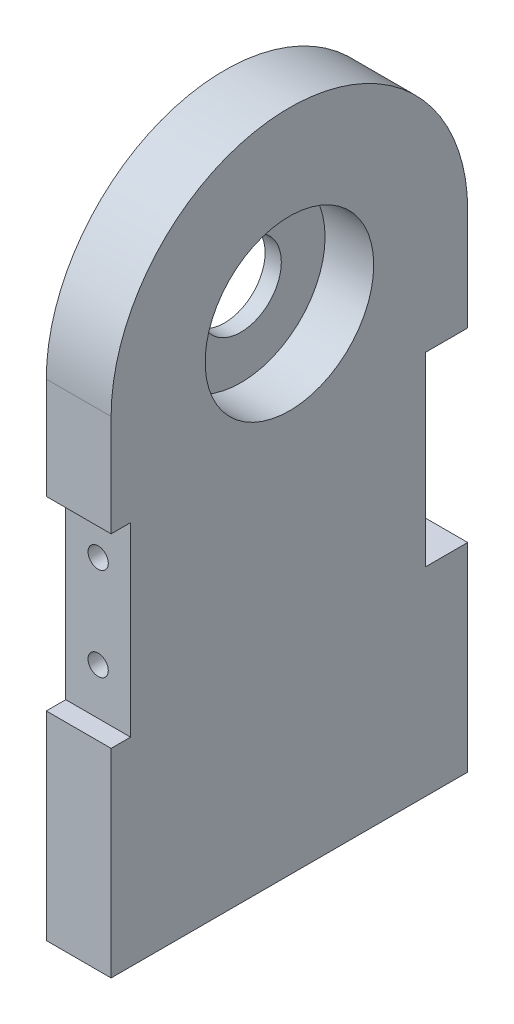
ISO-10303-21;
HEADER;
FILE_DESCRIPTION(('STEP AP214'),'2;1');
FILE_NAME('part.step','',(''),(''),'','','');
FILE_SCHEMA(('AUTOMOTIVE_DESIGN { 1 0 10303 214 1 1 1 1 }'));
ENDSEC;
DATA;
#1=APPLICATION_CONTEXT('core data for automotive mechanical design processes');
#2=APPLICATION_PROTOCOL_DEFINITION('international standard','automotive_design',2000,#1);
#3=PRODUCT_CONTEXT('',#1,'mechanical');
#4=PRODUCT('Part','Part','',(#3));
#5=PRODUCT_RELATED_PRODUCT_CATEGORY('part','',(#4));
#6=PRODUCT_DEFINITION_FORMATION('','',#4);
#7=PRODUCT_DEFINITION_CONTEXT('part definition',#1,'design');
#8=PRODUCT_DEFINITION('design','',#6,#7);
#9=PRODUCT_DEFINITION_SHAPE('','',#8);
#10=(LENGTH_UNIT() NAMED_UNIT(*) SI_UNIT(.MILLI.,.METRE.));
#11=(NAMED_UNIT(*) PLANE_ANGLE_UNIT() SI_UNIT($,.RADIAN.));
#12=(NAMED_UNIT(*) SI_UNIT($,.STERADIAN.) SOLID_ANGLE_UNIT());
#13=UNCERTAINTY_MEASURE_WITH_UNIT(LENGTH_MEASURE(1.E-05),#10,'distance_accuracy_value','');
#14=(GEOMETRIC_REPRESENTATION_CONTEXT(3) GLOBAL_UNCERTAINTY_ASSIGNED_CONTEXT((#13)) GLOBAL_UNIT_ASSIGNED_CONTEXT((#10,
#11,#12)) REPRESENTATION_CONTEXT('',''));
#15=CARTESIAN_POINT('',(0.,0.,0.));
#16=DIRECTION('',(0.,0.,1.));
#17=DIRECTION('',(1.,0.,0.));
#18=AXIS2_PLACEMENT_3D('',#15,#16,#17);
#19=CARTESIAN_POINT('',(20.,0.,-55.));
#20=DIRECTION('',(0.,0.,-1.));
#21=DIRECTION('',(0.,1.,0.));
#22=AXIS2_PLACEMENT_3D('',#19,#20,#21);
#23=PLANE('',#22);
#24=DIRECTION('',(1.,0.,0.));
#25=VECTOR('',#24,1.);
#26=CARTESIAN_POINT('',(0.,-13.65,-55.));
#27=LINE('',#26,#25);
#28=CARTESIAN_POINT('',(0.,-13.65,-55.));
#29=VERTEX_POINT('',#28);
#30=CARTESIAN_POINT('',(20.,-13.65,-55.));
#31=VERTEX_POINT('',#30);
#32=EDGE_CURVE('E247',#29,#31,#27,.T.);
#33=ORIENTED_EDGE('',*,*,#32,.T.);
#34=DIRECTION('',(0.,-1.,0.));
#35=VECTOR('',#34,1.);
#36=CARTESIAN_POINT('',(20.,0.,-55.));
#37=LINE('',#36,#35);
#38=CARTESIAN_POINT('',(20.,-75.,-55.));
#39=VERTEX_POINT('',#38);
#40=EDGE_CURVE('E325',#31,#39,#37,.T.);
#41=ORIENTED_EDGE('',*,*,#40,.T.);
#42=DIRECTION('',(-1.,0.,0.));
#43=VECTOR('',#42,1.);
#44=CARTESIAN_POINT('',(20.,-75.,-55.));
#45=LINE('',#44,#43);
#46=CARTESIAN_POINT('',(0.,-75.,-55.));
#47=VERTEX_POINT('',#46);
#48=EDGE_CURVE('E337',#39,#47,#45,.T.);
#49=ORIENTED_EDGE('',*,*,#48,.T.);
#50=DIRECTION('',(0.,-1.,0.));
#51=VECTOR('',#50,1.);
#52=CARTESIAN_POINT('',(0.,0.,-55.));
#53=LINE('',#52,#51);
#54=EDGE_CURVE('E315',#29,#47,#53,.T.);
#55=ORIENTED_EDGE('',*,*,#54,.F.);
#56=EDGE_LOOP('',(#33,#41,#49,#55));
#57=FACE_BOUND('',#56,.T.);
#58=ADVANCED_FACE('F43',(#57),#23,.T.);
#59=CARTESIAN_POINT('',(20.,0.,55.));
#60=DIRECTION('',(0.,0.,-1.));
#61=DIRECTION('',(0.,1.,0.));
#62=AXIS2_PLACEMENT_3D('',#59,#60,#61);
#63=PLANE('',#62);
#64=DIRECTION('',(0.,-1.,0.));
#65=VECTOR('',#64,1.);
#66=CARTESIAN_POINT('',(20.,0.,55.));
#67=LINE('',#66,#65);
#68=CARTESIAN_POINT('',(20.,-13.65,55.));
#69=VERTEX_POINT('',#68);
#70=CARTESIAN_POINT('',(20.,-75.,55.));
#71=VERTEX_POINT('',#70);
#72=EDGE_CURVE('E328',#69,#71,#67,.T.);
#73=ORIENTED_EDGE('',*,*,#72,.F.);
#74=DIRECTION('',(1.,0.,0.));
#75=VECTOR('',#74,1.);
#76=CARTESIAN_POINT('',(0.,-13.65,55.));
#77=LINE('',#76,#75);
#78=CARTESIAN_POINT('',(0.,-13.65,55.));
#79=VERTEX_POINT('',#78);
#80=EDGE_CURVE('E223',#79,#69,#77,.T.);
#81=ORIENTED_EDGE('',*,*,#80,.F.);
#82=DIRECTION('',(0.,-1.,0.));
#83=VECTOR('',#82,1.);
#84=CARTESIAN_POINT('',(0.,0.,55.));
#85=LINE('',#84,#83);
#86=CARTESIAN_POINT('',(0.,-75.,55.));
#87=VERTEX_POINT('',#86);
#88=EDGE_CURVE('E345',#79,#87,#85,.T.);
#89=ORIENTED_EDGE('',*,*,#88,.T.);
#90=DIRECTION('',(-1.,0.,0.));
#91=VECTOR('',#90,1.);
#92=CARTESIAN_POINT('',(20.,-75.,55.));
#93=LINE('',#92,#91);
#94=EDGE_CURVE('E357',#71,#87,#93,.T.);
#95=ORIENTED_EDGE('',*,*,#94,.F.);
#96=EDGE_LOOP('',(#73,#81,#89,#95));
#97=FACE_BOUND('',#96,.T.);
#98=ADVANCED_FACE('F427',(#97),#63,.F.);
#99=DIRECTION('',(1.,0.,0.));
#100=VECTOR('',#99,1.);
#101=CARTESIAN_POINT('',(0.,43.65,-55.));
#102=LINE('',#101,#100);
#103=CARTESIAN_POINT('',(0.,43.65,-55.));
#104=VERTEX_POINT('',#103);
#105=CARTESIAN_POINT('',(20.,43.65,-55.));
#106=VERTEX_POINT('',#105);
#107=EDGE_CURVE('E262',#104,#106,#102,.T.);
#108=ORIENTED_EDGE('',*,*,#107,.F.);
#109=CARTESIAN_POINT('',(0.,75.,-55.));
#110=VERTEX_POINT('',#109);
#111=EDGE_CURVE('E338',#110,#104,#53,.T.);
#112=ORIENTED_EDGE('',*,*,#111,.F.);
#113=DIRECTION('',(-1.,0.,0.));
#114=VECTOR('',#113,1.);
#115=CARTESIAN_POINT('',(20.,75.,-55.));
#116=LINE('',#115,#114);
#117=CARTESIAN_POINT('',(20.,75.,-55.));
#118=VERTEX_POINT('',#117);
#119=EDGE_CURVE('E11',#118,#110,#116,.T.);
#120=ORIENTED_EDGE('',*,*,#119,.F.);
#121=EDGE_CURVE('E320',#118,#106,#37,.T.);
#122=ORIENTED_EDGE('',*,*,#121,.T.);
#123=EDGE_LOOP('',(#108,#112,#120,#122));
#124=FACE_BOUND('',#123,.T.);
#125=ADVANCED_FACE('F45',(#124),#23,.T.);
#126=CARTESIAN_POINT('',(20.,75.,0.));
#127=DIRECTION('',(-1.,0.,0.));
#128=DIRECTION('',(0.,0.,1.));
#129=AXIS2_PLACEMENT_3D('',#126,#127,#128);
#130=CYLINDRICAL_SURFACE('',#129,55.);
#131=CARTESIAN_POINT('',(0.,75.,0.));
#132=DIRECTION('',(1.,0.,0.));
#133=DIRECTION('',(0.,0.,-1.));
#134=AXIS2_PLACEMENT_3D('',#131,#132,#133);
#135=CIRCLE('',#134,55.);
#136=CARTESIAN_POINT('',(0.,75.,55.));
#137=VERTEX_POINT('',#136);
#138=EDGE_CURVE('E342',#110,#137,#135,.T.);
#139=ORIENTED_EDGE('',*,*,#138,.T.);
#140=DIRECTION('',(-1.,0.,0.));
#141=VECTOR('',#140,1.);
#142=CARTESIAN_POINT('',(20.,75.,55.));
#143=LINE('',#142,#141);
#144=CARTESIAN_POINT('',(20.,75.,55.));
#145=VERTEX_POINT('',#144);
#146=EDGE_CURVE('E53',#145,#137,#143,.T.);
#147=ORIENTED_EDGE('',*,*,#146,.F.);
#148=CARTESIAN_POINT('',(20.,75.,0.));
#149=DIRECTION('',(1.,0.,0.));
#150=DIRECTION('',(0.,0.,-1.));
#151=AXIS2_PLACEMENT_3D('',#148,#149,#150);
#152=CIRCLE('',#151,55.);
#153=EDGE_CURVE('E324',#118,#145,#152,.T.);
#154=ORIENTED_EDGE('',*,*,#153,.F.);
#155=ORIENTED_EDGE('',*,*,#119,.T.);
#156=EDGE_LOOP('',(#139,#147,#154,#155));
#157=FACE_BOUND('',#156,.T.);
#158=ADVANCED_FACE('F388',(#157),#130,.T.);
#159=CARTESIAN_POINT('',(0.,43.65,55.));
#160=VERTEX_POINT('',#159);
#161=EDGE_CURVE('E346',#137,#160,#85,.T.);
#162=ORIENTED_EDGE('',*,*,#161,.T.);
#163=DIRECTION('',(1.,0.,0.));
#164=VECTOR('',#163,1.);
#165=CARTESIAN_POINT('',(0.,43.65,55.));
#166=LINE('',#165,#164);
#167=CARTESIAN_POINT('',(20.,43.65,55.));
#168=VERTEX_POINT('',#167);
#169=EDGE_CURVE('E227',#160,#168,#166,.T.);
#170=ORIENTED_EDGE('',*,*,#169,.T.);
#171=EDGE_CURVE('E329',#145,#168,#67,.T.);
#172=ORIENTED_EDGE('',*,*,#171,.F.);
#173=ORIENTED_EDGE('',*,*,#146,.T.);
#174=EDGE_LOOP('',(#162,#170,#172,#173));
#175=FACE_BOUND('',#174,.T.);
#176=ADVANCED_FACE('F367',(#175),#63,.F.);
#177=CARTESIAN_POINT('',(20.,-75.,0.));
#178=DIRECTION('',(0.,-1.,0.));
#179=DIRECTION('',(0.,0.,-1.));
#180=AXIS2_PLACEMENT_3D('',#177,#178,#179);
#181=PLANE('',#180);
#182=CARTESIAN_POINT('',(10.,-75.,36.6666666666666));
#183=DIRECTION('',(0.,-1.,0.));
#184=DIRECTION('',(0.,0.,-1.));
#185=AXIS2_PLACEMENT_3D('',#182,#183,#184);
#186=CIRCLE('',#185,2.49999999999999);
#187=CARTESIAN_POINT('',(10.,-75.,34.1666666666667));
#188=VERTEX_POINT('',#187);
#189=EDGE_CURVE('E226',#188,#188,#186,.T.);
#190=ORIENTED_EDGE('',*,*,#189,.F.);
#191=EDGE_LOOP('',(#190));
#192=FACE_BOUND('',#191,.T.);
#193=CARTESIAN_POINT('',(10.,-75.,18.3333333333333));
#194=DIRECTION('',(0.,-1.,0.));
#195=DIRECTION('',(0.,0.,-1.));
#196=AXIS2_PLACEMENT_3D('',#193,#194,#195);
#197=CIRCLE('',#196,2.49999999999999);
#198=CARTESIAN_POINT('',(10.,-75.,15.8333333333333));
#199=VERTEX_POINT('',#198);
#200=EDGE_CURVE('E275',#199,#199,#197,.T.);
#201=ORIENTED_EDGE('',*,*,#200,.F.);
#202=EDGE_LOOP('',(#201));
#203=FACE_BOUND('',#202,.T.);
#204=CARTESIAN_POINT('',(10.,-75.,0.));
#205=DIRECTION('',(0.,-1.,0.));
#206=DIRECTION('',(0.,0.,-1.));
#207=AXIS2_PLACEMENT_3D('',#204,#205,#206);
#208=CIRCLE('',#207,2.49999999999999);
#209=CARTESIAN_POINT('',(10.,-75.,-2.50000000000001));
#210=VERTEX_POINT('',#209);
#211=EDGE_CURVE('E283',#210,#210,#208,.T.);
#212=ORIENTED_EDGE('',*,*,#211,.F.);
#213=EDGE_LOOP('',(#212));
#214=FACE_BOUND('',#213,.T.);
#215=CARTESIAN_POINT('',(10.,-75.,-18.3333333333334));
#216=DIRECTION('',(0.,-1.,0.));
#217=DIRECTION('',(0.,0.,-1.));
#218=AXIS2_PLACEMENT_3D('',#215,#216,#217);
#219=CIRCLE('',#218,2.49999999999999);
#220=CARTESIAN_POINT('',(10.,-75.,-20.8333333333333));
#221=VERTEX_POINT('',#220);
#222=EDGE_CURVE('E291',#221,#221,#219,.T.);
#223=ORIENTED_EDGE('',*,*,#222,.F.);
#224=EDGE_LOOP('',(#223));
#225=FACE_BOUND('',#224,.T.);
#226=CARTESIAN_POINT('',(10.,-75.,-36.6666666666667));
#227=DIRECTION('',(0.,-1.,0.));
#228=DIRECTION('',(0.,0.,-1.));
#229=AXIS2_PLACEMENT_3D('',#226,#227,#228);
#230=CIRCLE('',#229,2.49999999999999);
#231=CARTESIAN_POINT('',(10.,-75.,-39.1666666666667));
#232=VERTEX_POINT('',#231);
#233=EDGE_CURVE('E299',#232,#232,#230,.T.);
#234=ORIENTED_EDGE('',*,*,#233,.F.);
#235=EDGE_LOOP('',(#234));
#236=FACE_BOUND('',#235,.T.);
#237=DIRECTION('',(0.,0.,1.));
#238=VECTOR('',#237,1.);
#239=CARTESIAN_POINT('',(0.,-75.,0.));
#240=LINE('',#239,#238);
#241=EDGE_CURVE('E350',#47,#87,#240,.T.);
#242=ORIENTED_EDGE('',*,*,#241,.F.);
#243=ORIENTED_EDGE('',*,*,#48,.F.);
#244=DIRECTION('',(0.,0.,1.));
#245=VECTOR('',#244,1.);
#246=CARTESIAN_POINT('',(20.,-75.,0.));
#247=LINE('',#246,#245);
#248=EDGE_CURVE('E333',#39,#71,#247,.T.);
#249=ORIENTED_EDGE('',*,*,#248,.T.);
#250=ORIENTED_EDGE('',*,*,#94,.T.);
#251=EDGE_LOOP('',(#242,#243,#249,#250));
#252=FACE_BOUND('',#251,.T.);
#253=ADVANCED_FACE('F440',(#192,#203,#214,#225,#236,#252),#181,.T.);
#254=CARTESIAN_POINT('',(20.,0.,0.));
#255=DIRECTION('',(1.,0.,0.));
#256=DIRECTION('',(0.,0.,-1.));
#257=AXIS2_PLACEMENT_3D('',#254,#255,#256);
#258=PLANE('',#257);
#259=DIRECTION('',(0.,0.,-1.));
#260=VECTOR('',#259,1.);
#261=CARTESIAN_POINT('',(20.,-13.65,49.));
#262=LINE('',#261,#260);
#263=CARTESIAN_POINT('',(20.,-13.65,49.));
#264=VERTEX_POINT('',#263);
#265=EDGE_CURVE('E212',#69,#264,#262,.T.);
#266=ORIENTED_EDGE('',*,*,#265,.F.);
#267=ORIENTED_EDGE('',*,*,#72,.T.);
#268=ORIENTED_EDGE('',*,*,#248,.F.);
#269=ORIENTED_EDGE('',*,*,#40,.F.);
#270=DIRECTION('',(0.,0.,-1.));
#271=VECTOR('',#270,1.);
#272=CARTESIAN_POINT('',(20.,-13.65,-42.));
#273=LINE('',#272,#271);
#274=CARTESIAN_POINT('',(20.,-13.65,-42.));
#275=VERTEX_POINT('',#274);
#276=EDGE_CURVE('E199',#275,#31,#273,.T.);
#277=ORIENTED_EDGE('',*,*,#276,.F.);
#278=DIRECTION('',(0.,-1.,0.));
#279=VECTOR('',#278,1.);
#280=CARTESIAN_POINT('',(20.,43.65,-42.));
#281=LINE('',#280,#279);
#282=CARTESIAN_POINT('',(20.,43.65,-42.));
#283=VERTEX_POINT('',#282);
#284=EDGE_CURVE('E241',#283,#275,#281,.T.);
#285=ORIENTED_EDGE('',*,*,#284,.F.);
#286=DIRECTION('',(0.,0.,1.));
#287=VECTOR('',#286,1.);
#288=CARTESIAN_POINT('',(20.,43.65,-55.));
#289=LINE('',#288,#287);
#290=EDGE_CURVE('E250',#106,#283,#289,.T.);
#291=ORIENTED_EDGE('',*,*,#290,.F.);
#292=ORIENTED_EDGE('',*,*,#121,.F.);
#293=ORIENTED_EDGE('',*,*,#153,.T.);
#294=ORIENTED_EDGE('',*,*,#171,.T.);
#295=DIRECTION('',(0.,0.,1.));
#296=VECTOR('',#295,1.);
#297=CARTESIAN_POINT('',(20.,43.65,55.));
#298=LINE('',#297,#296);
#299=CARTESIAN_POINT('',(20.,43.65,49.));
#300=VERTEX_POINT('',#299);
#301=EDGE_CURVE('E205',#300,#168,#298,.T.);
#302=ORIENTED_EDGE('',*,*,#301,.F.);
#303=DIRECTION('',(0.,1.,0.));
#304=VECTOR('',#303,1.);
#305=CARTESIAN_POINT('',(20.,43.65,49.));
#306=LINE('',#305,#304);
#307=EDGE_CURVE('E216',#264,#300,#306,.T.);
#308=ORIENTED_EDGE('',*,*,#307,.F.);
#309=EDGE_LOOP('',(#266,#267,#268,#269,#277,#285,#291,#292,#293,#294,#302,#308));
#310=FACE_BOUND('',#309,.T.);
#311=CARTESIAN_POINT('',(20.,75.,0.));
#312=DIRECTION('',(1.,0.,0.));
#313=DIRECTION('',(0.,0.,-1.));
#314=AXIS2_PLACEMENT_3D('',#311,#312,#313);
#315=CIRCLE('',#314,26.);
#316=CARTESIAN_POINT('',(20.,75.,-26.));
#317=VERTEX_POINT('',#316);
#318=EDGE_CURVE('E316',#317,#317,#315,.T.);
#319=ORIENTED_EDGE('',*,*,#318,.F.);
#320=EDGE_LOOP('',(#319));
#321=FACE_BOUND('',#320,.T.);
#322=ADVANCED_FACE('F384',(#310,#321),#258,.T.);
#323=CARTESIAN_POINT('',(0.,0.,0.));
#324=DIRECTION('',(1.,0.,0.));
#325=DIRECTION('',(0.,0.,-1.));
#326=AXIS2_PLACEMENT_3D('',#323,#324,#325);
#327=PLANE('',#326);
#328=ORIENTED_EDGE('',*,*,#88,.F.);
#329=DIRECTION('',(0.,0.,-1.));
#330=VECTOR('',#329,1.);
#331=CARTESIAN_POINT('',(0.,-13.65,49.));
#332=LINE('',#331,#330);
#333=CARTESIAN_POINT('',(0.,-13.65,49.));
#334=VERTEX_POINT('',#333);
#335=EDGE_CURVE('E200',#79,#334,#332,.T.);
#336=ORIENTED_EDGE('',*,*,#335,.T.);
#337=DIRECTION('',(0.,1.,0.));
#338=VECTOR('',#337,1.);
#339=CARTESIAN_POINT('',(0.,43.65,49.));
#340=LINE('',#339,#338);
#341=CARTESIAN_POINT('',(0.,43.65,49.));
#342=VERTEX_POINT('',#341);
#343=EDGE_CURVE('E204',#334,#342,#340,.T.);
#344=ORIENTED_EDGE('',*,*,#343,.T.);
#345=DIRECTION('',(0.,0.,1.));
#346=VECTOR('',#345,1.);
#347=CARTESIAN_POINT('',(0.,43.65,55.));
#348=LINE('',#347,#346);
#349=EDGE_CURVE('E60',#342,#160,#348,.T.);
#350=ORIENTED_EDGE('',*,*,#349,.T.);
#351=ORIENTED_EDGE('',*,*,#161,.F.);
#352=ORIENTED_EDGE('',*,*,#138,.F.);
#353=ORIENTED_EDGE('',*,*,#111,.T.);
#354=DIRECTION('',(0.,0.,1.));
#355=VECTOR('',#354,1.);
#356=CARTESIAN_POINT('',(0.,43.65,-55.));
#357=LINE('',#356,#355);
#358=CARTESIAN_POINT('',(0.,43.65,-42.));
#359=VERTEX_POINT('',#358);
#360=EDGE_CURVE('E240',#104,#359,#357,.T.);
#361=ORIENTED_EDGE('',*,*,#360,.T.);
#362=DIRECTION('',(0.,-1.,0.));
#363=VECTOR('',#362,1.);
#364=CARTESIAN_POINT('',(0.,43.65,-42.));
#365=LINE('',#364,#363);
#366=CARTESIAN_POINT('',(0.,-13.65,-42.));
#367=VERTEX_POINT('',#366);
#368=EDGE_CURVE('E68',#359,#367,#365,.T.);
#369=ORIENTED_EDGE('',*,*,#368,.T.);
#370=DIRECTION('',(0.,0.,-1.));
#371=VECTOR('',#370,1.);
#372=CARTESIAN_POINT('',(0.,-13.65,-42.));
#373=LINE('',#372,#371);
#374=EDGE_CURVE('E236',#367,#29,#373,.T.);
#375=ORIENTED_EDGE('',*,*,#374,.T.);
#376=ORIENTED_EDGE('',*,*,#54,.T.);
#377=ORIENTED_EDGE('',*,*,#241,.T.);
#378=EDGE_LOOP('',(#328,#336,#344,#350,#351,#352,#353,#361,#369,#375,#376,#377));
#379=FACE_BOUND('',#378,.T.);
#380=CARTESIAN_POINT('',(0.,75.,0.));
#381=DIRECTION('',(1.,0.,0.));
#382=DIRECTION('',(0.,0.,-1.));
#383=AXIS2_PLACEMENT_3D('',#380,#381,#382);
#384=CIRCLE('',#383,12.5);
#385=CARTESIAN_POINT('',(0.,75.,-12.5));
#386=VERTEX_POINT('',#385);
#387=EDGE_CURVE('E47',#386,#386,#384,.T.);
#388=ORIENTED_EDGE('',*,*,#387,.T.);
#389=EDGE_LOOP('',(#388));
#390=FACE_BOUND('',#389,.T.);
#391=ADVANCED_FACE('F373',(#379,#390),#327,.F.);
#392=CARTESIAN_POINT('',(5.,75.,0.));
#393=DIRECTION('',(1.,0.,0.));
#394=DIRECTION('',(0.,0.,-1.));
#395=AXIS2_PLACEMENT_3D('',#392,#393,#394);
#396=CYLINDRICAL_SURFACE('',#395,26.);
#397=CARTESIAN_POINT('',(5.,75.,0.));
#398=DIRECTION('',(1.,0.,0.));
#399=DIRECTION('',(0.,0.,-1.));
#400=AXIS2_PLACEMENT_3D('',#397,#398,#399);
#401=CIRCLE('',#400,26.);
#402=CARTESIAN_POINT('',(5.,75.,-26.));
#403=VERTEX_POINT('',#402);
#404=EDGE_CURVE('E311',#403,#403,#401,.T.);
#405=ORIENTED_EDGE('',*,*,#404,.F.);
#406=EDGE_LOOP('',(#405));
#407=FACE_BOUND('',#406,.T.);
#408=ORIENTED_EDGE('',*,*,#318,.T.);
#409=EDGE_LOOP('',(#408));
#410=FACE_BOUND('',#409,.T.);
#411=ADVANCED_FACE('F423',(#407,#410),#396,.F.);
#412=CARTESIAN_POINT('',(5.,75.,0.));
#413=DIRECTION('',(1.,0.,0.));
#414=DIRECTION('',(0.,0.,-1.));
#415=AXIS2_PLACEMENT_3D('',#412,#413,#414);
#416=PLANE('',#415);
#417=CARTESIAN_POINT('',(5.,75.,0.));
#418=DIRECTION('',(1.,0.,0.));
#419=DIRECTION('',(0.,0.,-1.));
#420=AXIS2_PLACEMENT_3D('',#417,#418,#419);
#421=CIRCLE('',#420,12.5);
#422=CARTESIAN_POINT('',(5.,75.,-12.5));
#423=VERTEX_POINT('',#422);
#424=EDGE_CURVE('E307',#423,#423,#421,.T.);
#425=ORIENTED_EDGE('',*,*,#424,.F.);
#426=EDGE_LOOP('',(#425));
#427=FACE_BOUND('',#426,.T.);
#428=ORIENTED_EDGE('',*,*,#404,.T.);
#429=EDGE_LOOP('',(#428));
#430=FACE_BOUND('',#429,.T.);
#431=ADVANCED_FACE('F413',(#427,#430),#416,.T.);
#432=CARTESIAN_POINT('',(-6.1125,75.,0.));
#433=DIRECTION('',(1.,0.,0.));
#434=DIRECTION('',(0.,0.,-1.));
#435=AXIS2_PLACEMENT_3D('',#432,#433,#434);
#436=CYLINDRICAL_SURFACE('',#435,12.5);
#437=ORIENTED_EDGE('',*,*,#424,.T.);
#438=EDGE_LOOP('',(#437));
#439=FACE_BOUND('',#438,.T.);
#440=ORIENTED_EDGE('',*,*,#387,.F.);
#441=EDGE_LOOP('',(#440));
#442=FACE_BOUND('',#441,.T.);
#443=ADVANCED_FACE('F410',(#439,#442),#436,.F.);
#444=CARTESIAN_POINT('',(10.,-35.,-36.6666666666667));
#445=DIRECTION('',(0.,-1.,0.));
#446=DIRECTION('',(0.,0.,-1.));
#447=AXIS2_PLACEMENT_3D('',#444,#445,#446);
#448=CONICAL_SURFACE('',#447,2.5,1.02974425867665);
#449=CARTESIAN_POINT('',(9.99999999999999,-33.4978484524311,-36.6666666666667));
#450=VERTEX_POINT('',#449);
#451=VERTEX_LOOP('',#450);
#452=FACE_BOUND('',#451,.T.);
#453=CARTESIAN_POINT('',(10.,-35.,-36.6666666666667));
#454=DIRECTION('',(0.,-1.,0.));
#455=DIRECTION('',(0.,0.,-1.));
#456=AXIS2_PLACEMENT_3D('',#453,#454,#455);
#457=CIRCLE('',#456,2.5);
#458=CARTESIAN_POINT('',(10.,-35.,-39.1666666666667));
#459=VERTEX_POINT('',#458);
#460=EDGE_CURVE('E303',#459,#459,#457,.T.);
#461=ORIENTED_EDGE('',*,*,#460,.T.);
#462=EDGE_LOOP('',(#461));
#463=FACE_BOUND('',#462,.T.);
#464=ADVANCED_FACE('F412',(#452,#463),#448,.F.);
#465=CARTESIAN_POINT('',(10.,-75.,-36.6666666666667));
#466=DIRECTION('',(0.,-1.,0.));
#467=DIRECTION('',(0.,0.,-1.));
#468=AXIS2_PLACEMENT_3D('',#465,#466,#467);
#469=CYLINDRICAL_SURFACE('',#468,2.49999999999999);
#470=ORIENTED_EDGE('',*,*,#460,.F.);
#471=EDGE_LOOP('',(#470));
#472=FACE_BOUND('',#471,.T.);
#473=ORIENTED_EDGE('',*,*,#233,.T.);
#474=EDGE_LOOP('',(#473));
#475=FACE_BOUND('',#474,.T.);
#476=ADVANCED_FACE('F420',(#472,#475),#469,.F.);
#477=CARTESIAN_POINT('',(10.,-35.,-18.3333333333334));
#478=DIRECTION('',(0.,-1.,0.));
#479=DIRECTION('',(0.,0.,-1.));
#480=AXIS2_PLACEMENT_3D('',#477,#478,#479);
#481=CONICAL_SURFACE('',#480,2.5,1.02974425867665);
#482=CARTESIAN_POINT('',(9.99999999999999,-33.4978484524311,-18.3333333333334));
#483=VERTEX_POINT('',#482);
#484=VERTEX_LOOP('',#483);
#485=FACE_BOUND('',#484,.T.);
#486=CARTESIAN_POINT('',(10.,-35.,-18.3333333333334));
#487=DIRECTION('',(0.,-1.,0.));
#488=DIRECTION('',(0.,0.,-1.));
#489=AXIS2_PLACEMENT_3D('',#486,#487,#488);
#490=CIRCLE('',#489,2.5);
#491=CARTESIAN_POINT('',(10.,-35.,-20.8333333333333));
#492=VERTEX_POINT('',#491);
#493=EDGE_CURVE('E295',#492,#492,#490,.T.);
#494=ORIENTED_EDGE('',*,*,#493,.T.);
#495=EDGE_LOOP('',(#494));
#496=FACE_BOUND('',#495,.T.);
#497=ADVANCED_FACE('F490',(#485,#496),#481,.F.);
#498=CARTESIAN_POINT('',(10.,-75.,-18.3333333333334));
#499=DIRECTION('',(0.,-1.,0.));
#500=DIRECTION('',(0.,0.,-1.));
#501=AXIS2_PLACEMENT_3D('',#498,#499,#500);
#502=CYLINDRICAL_SURFACE('',#501,2.49999999999999);
#503=ORIENTED_EDGE('',*,*,#493,.F.);
#504=EDGE_LOOP('',(#503));
#505=FACE_BOUND('',#504,.T.);
#506=ORIENTED_EDGE('',*,*,#222,.T.);
#507=EDGE_LOOP('',(#506));
#508=FACE_BOUND('',#507,.T.);
#509=ADVANCED_FACE('F500',(#505,#508),#502,.F.);
#510=CARTESIAN_POINT('',(10.,-35.,0.));
#511=DIRECTION('',(0.,-1.,0.));
#512=DIRECTION('',(0.,0.,-1.));
#513=AXIS2_PLACEMENT_3D('',#510,#511,#512);
#514=CONICAL_SURFACE('',#513,2.5,1.02974425867665);
#515=CARTESIAN_POINT('',(9.99999999999999,-33.4978484524311,0.));
#516=VERTEX_POINT('',#515);
#517=VERTEX_LOOP('',#516);
#518=FACE_BOUND('',#517,.T.);
#519=CARTESIAN_POINT('',(10.,-35.,0.));
#520=DIRECTION('',(0.,-1.,0.));
#521=DIRECTION('',(0.,0.,-1.));
#522=AXIS2_PLACEMENT_3D('',#519,#520,#521);
#523=CIRCLE('',#522,2.5);
#524=CARTESIAN_POINT('',(10.,-35.,-2.50000000000002));
#525=VERTEX_POINT('',#524);
#526=EDGE_CURVE('E287',#525,#525,#523,.T.);
#527=ORIENTED_EDGE('',*,*,#526,.T.);
#528=EDGE_LOOP('',(#527));
#529=FACE_BOUND('',#528,.T.);
#530=ADVANCED_FACE('F510',(#518,#529),#514,.F.);
#531=CARTESIAN_POINT('',(10.,-75.,0.));
#532=DIRECTION('',(0.,-1.,0.));
#533=DIRECTION('',(0.,0.,-1.));
#534=AXIS2_PLACEMENT_3D('',#531,#532,#533);
#535=CYLINDRICAL_SURFACE('',#534,2.49999999999999);
#536=ORIENTED_EDGE('',*,*,#526,.F.);
#537=EDGE_LOOP('',(#536));
#538=FACE_BOUND('',#537,.T.);
#539=ORIENTED_EDGE('',*,*,#211,.T.);
#540=EDGE_LOOP('',(#539));
#541=FACE_BOUND('',#540,.T.);
#542=ADVANCED_FACE('F520',(#538,#541),#535,.F.);
#543=CARTESIAN_POINT('',(10.,-35.,18.3333333333333));
#544=DIRECTION('',(0.,-1.,0.));
#545=DIRECTION('',(0.,0.,-1.));
#546=AXIS2_PLACEMENT_3D('',#543,#544,#545);
#547=CONICAL_SURFACE('',#546,2.5,1.02974425867665);
#548=CARTESIAN_POINT('',(9.99999999999999,-33.4978484524311,18.3333333333333));
#549=VERTEX_POINT('',#548);
#550=VERTEX_LOOP('',#549);
#551=FACE_BOUND('',#550,.T.);
#552=CARTESIAN_POINT('',(10.,-35.,18.3333333333333));
#553=DIRECTION('',(0.,-1.,0.));
#554=DIRECTION('',(0.,0.,-1.));
#555=AXIS2_PLACEMENT_3D('',#552,#553,#554);
#556=CIRCLE('',#555,2.5);
#557=CARTESIAN_POINT('',(10.,-35.,15.8333333333333));
#558=VERTEX_POINT('',#557);
#559=EDGE_CURVE('E279',#558,#558,#556,.T.);
#560=ORIENTED_EDGE('',*,*,#559,.T.);
#561=EDGE_LOOP('',(#560));
#562=FACE_BOUND('',#561,.T.);
#563=ADVANCED_FACE('F530',(#551,#562),#547,.F.);
#564=CARTESIAN_POINT('',(10.,-75.,18.3333333333333));
#565=DIRECTION('',(0.,-1.,0.));
#566=DIRECTION('',(0.,0.,-1.));
#567=AXIS2_PLACEMENT_3D('',#564,#565,#566);
#568=CYLINDRICAL_SURFACE('',#567,2.49999999999999);
#569=ORIENTED_EDGE('',*,*,#559,.F.);
#570=EDGE_LOOP('',(#569));
#571=FACE_BOUND('',#570,.T.);
#572=ORIENTED_EDGE('',*,*,#200,.T.);
#573=EDGE_LOOP('',(#572));
#574=FACE_BOUND('',#573,.T.);
#575=ADVANCED_FACE('F540',(#571,#574),#568,.F.);
#576=CARTESIAN_POINT('',(10.,-35.,36.6666666666666));
#577=DIRECTION('',(0.,-1.,0.));
#578=DIRECTION('',(0.,0.,-1.));
#579=AXIS2_PLACEMENT_3D('',#576,#577,#578);
#580=CONICAL_SURFACE('',#579,2.5,1.02974425867665);
#581=CARTESIAN_POINT('',(9.99999999999999,-33.4978484524311,36.6666666666666));
#582=VERTEX_POINT('',#581);
#583=VERTEX_LOOP('',#582);
#584=FACE_BOUND('',#583,.T.);
#585=CARTESIAN_POINT('',(10.,-35.,36.6666666666666));
#586=DIRECTION('',(0.,-1.,0.));
#587=DIRECTION('',(0.,0.,-1.));
#588=AXIS2_PLACEMENT_3D('',#585,#586,#587);
#589=CIRCLE('',#588,2.5);
#590=CARTESIAN_POINT('',(10.,-35.,34.1666666666667));
#591=VERTEX_POINT('',#590);
#592=EDGE_CURVE('E271',#591,#591,#589,.T.);
#593=ORIENTED_EDGE('',*,*,#592,.T.);
#594=EDGE_LOOP('',(#593));
#595=FACE_BOUND('',#594,.T.);
#596=ADVANCED_FACE('F550',(#584,#595),#580,.F.);
#597=CARTESIAN_POINT('',(10.,-75.,36.6666666666666));
#598=DIRECTION('',(0.,-1.,0.));
#599=DIRECTION('',(0.,0.,-1.));
#600=AXIS2_PLACEMENT_3D('',#597,#598,#599);
#601=CYLINDRICAL_SURFACE('',#600,2.49999999999999);
#602=ORIENTED_EDGE('',*,*,#592,.F.);
#603=EDGE_LOOP('',(#602));
#604=FACE_BOUND('',#603,.T.);
#605=ORIENTED_EDGE('',*,*,#189,.T.);
#606=EDGE_LOOP('',(#605));
#607=FACE_BOUND('',#606,.T.);
#608=ADVANCED_FACE('F560',(#604,#607),#601,.F.);
#609=CARTESIAN_POINT('',(0.,-13.65,-42.));
#610=DIRECTION('',(0.,-1.,0.));
#611=DIRECTION('',(0.,0.,-1.));
#612=AXIS2_PLACEMENT_3D('',#609,#610,#611);
#613=PLANE('',#612);
#614=ORIENTED_EDGE('',*,*,#276,.T.);
#615=ORIENTED_EDGE('',*,*,#32,.F.);
#616=ORIENTED_EDGE('',*,*,#374,.F.);
#617=DIRECTION('',(1.,0.,0.));
#618=VECTOR('',#617,1.);
#619=CARTESIAN_POINT('',(0.,-13.65,-42.));
#620=LINE('',#619,#618);
#621=EDGE_CURVE('E217',#367,#275,#620,.T.);
#622=ORIENTED_EDGE('',*,*,#621,.T.);
#623=EDGE_LOOP('',(#614,#615,#616,#622));
#624=FACE_BOUND('',#623,.T.);
#625=ADVANCED_FACE('F400',(#624),#613,.F.);
#626=CARTESIAN_POINT('',(0.,43.65,-42.));
#627=DIRECTION('',(0.,0.,1.));
#628=DIRECTION('',(1.,0.,0.));
#629=AXIS2_PLACEMENT_3D('',#626,#627,#628);
#630=PLANE('',#629);
#631=CARTESIAN_POINT('',(10.,29.325,-42.));
#632=DIRECTION('',(0.,0.,-1.));
#633=DIRECTION('',(-1.,0.,0.));
#634=AXIS2_PLACEMENT_3D('',#631,#632,#633);
#635=CIRCLE('',#634,3.12499999999999);
#636=CARTESIAN_POINT('',(6.87500000000001,29.325,-42.));
#637=VERTEX_POINT('',#636);
#638=EDGE_CURVE('E170',#637,#637,#635,.T.);
#639=ORIENTED_EDGE('',*,*,#638,.F.);
#640=EDGE_LOOP('',(#639));
#641=FACE_BOUND('',#640,.T.);
#642=CARTESIAN_POINT('',(10.,0.674999999999995,-42.));
#643=DIRECTION('',(0.,0.,-1.));
#644=DIRECTION('',(-1.,0.,0.));
#645=AXIS2_PLACEMENT_3D('',#642,#643,#644);
#646=CIRCLE('',#645,3.12499999999999);
#647=CARTESIAN_POINT('',(6.87500000000001,0.674999999999995,-42.));
#648=VERTEX_POINT('',#647);
#649=EDGE_CURVE('E169',#648,#648,#646,.T.);
#650=ORIENTED_EDGE('',*,*,#649,.F.);
#651=EDGE_LOOP('',(#650));
#652=FACE_BOUND('',#651,.T.);
#653=ORIENTED_EDGE('',*,*,#284,.T.);
#654=ORIENTED_EDGE('',*,*,#621,.F.);
#655=ORIENTED_EDGE('',*,*,#368,.F.);
#656=DIRECTION('',(1.,0.,0.));
#657=VECTOR('',#656,1.);
#658=CARTESIAN_POINT('',(0.,43.65,-42.));
#659=LINE('',#658,#657);
#660=EDGE_CURVE('E259',#359,#283,#659,.T.);
#661=ORIENTED_EDGE('',*,*,#660,.T.);
#662=EDGE_LOOP('',(#653,#654,#655,#661));
#663=FACE_BOUND('',#662,.T.);
#664=ADVANCED_FACE('F394',(#641,#652,#663),#630,.F.);
#665=CARTESIAN_POINT('',(0.,43.65,-55.));
#666=DIRECTION('',(0.,1.,0.));
#667=DIRECTION('',(0.,0.,1.));
#668=AXIS2_PLACEMENT_3D('',#665,#666,#667);
#669=PLANE('',#668);
#670=ORIENTED_EDGE('',*,*,#290,.T.);
#671=ORIENTED_EDGE('',*,*,#660,.F.);
#672=ORIENTED_EDGE('',*,*,#360,.F.);
#673=ORIENTED_EDGE('',*,*,#107,.T.);
#674=EDGE_LOOP('',(#670,#671,#672,#673));
#675=FACE_BOUND('',#674,.T.);
#676=ADVANCED_FACE('F392',(#675),#669,.F.);
#677=CARTESIAN_POINT('',(0.,-13.65,49.));
#678=DIRECTION('',(0.,-1.,0.));
#679=DIRECTION('',(0.,0.,-1.));
#680=AXIS2_PLACEMENT_3D('',#677,#678,#679);
#681=PLANE('',#680);
#682=ORIENTED_EDGE('',*,*,#265,.T.);
#683=DIRECTION('',(1.,0.,0.));
#684=VECTOR('',#683,1.);
#685=CARTESIAN_POINT('',(0.,-13.65,49.));
#686=LINE('',#685,#684);
#687=EDGE_CURVE('E211',#334,#264,#686,.T.);
#688=ORIENTED_EDGE('',*,*,#687,.F.);
#689=ORIENTED_EDGE('',*,*,#335,.F.);
#690=ORIENTED_EDGE('',*,*,#80,.T.);
#691=EDGE_LOOP('',(#682,#688,#689,#690));
#692=FACE_BOUND('',#691,.T.);
#693=ADVANCED_FACE('F620',(#692),#681,.F.);
#694=CARTESIAN_POINT('',(0.,43.65,55.));
#695=DIRECTION('',(0.,1.,0.));
#696=DIRECTION('',(0.,0.,1.));
#697=AXIS2_PLACEMENT_3D('',#694,#695,#696);
#698=PLANE('',#697);
#699=ORIENTED_EDGE('',*,*,#301,.T.);
#700=ORIENTED_EDGE('',*,*,#169,.F.);
#701=ORIENTED_EDGE('',*,*,#349,.F.);
#702=DIRECTION('',(1.,0.,0.));
#703=VECTOR('',#702,1.);
#704=CARTESIAN_POINT('',(0.,43.65,49.));
#705=LINE('',#704,#703);
#706=EDGE_CURVE('E231',#342,#300,#705,.T.);
#707=ORIENTED_EDGE('',*,*,#706,.T.);
#708=EDGE_LOOP('',(#699,#700,#701,#707));
#709=FACE_BOUND('',#708,.T.);
#710=ADVANCED_FACE('F381',(#709),#698,.F.);
#711=CARTESIAN_POINT('',(0.,43.65,49.));
#712=DIRECTION('',(0.,0.,-1.));
#713=DIRECTION('',(-1.,0.,0.));
#714=AXIS2_PLACEMENT_3D('',#711,#712,#713);
#715=PLANE('',#714);
#716=CARTESIAN_POINT('',(10.,29.325,49.));
#717=DIRECTION('',(0.,0.,1.));
#718=DIRECTION('',(1.,0.,0.));
#719=AXIS2_PLACEMENT_3D('',#716,#717,#718);
#720=CIRCLE('',#719,3.12499999999999);
#721=CARTESIAN_POINT('',(13.125,29.325,49.));
#722=VERTEX_POINT('',#721);
#723=EDGE_CURVE('E183',#722,#722,#720,.T.);
#724=ORIENTED_EDGE('',*,*,#723,.F.);
#725=EDGE_LOOP('',(#724));
#726=FACE_BOUND('',#725,.T.);
#727=CARTESIAN_POINT('',(10.,0.675000000000002,49.));
#728=DIRECTION('',(0.,0.,1.));
#729=DIRECTION('',(1.,0.,0.));
#730=AXIS2_PLACEMENT_3D('',#727,#728,#729);
#731=CIRCLE('',#730,3.12499999999999);
#732=CARTESIAN_POINT('',(13.125,0.675000000000002,49.));
#733=VERTEX_POINT('',#732);
#734=EDGE_CURVE('E191',#733,#733,#731,.T.);
#735=ORIENTED_EDGE('',*,*,#734,.F.);
#736=EDGE_LOOP('',(#735));
#737=FACE_BOUND('',#736,.T.);
#738=ORIENTED_EDGE('',*,*,#307,.T.);
#739=ORIENTED_EDGE('',*,*,#706,.F.);
#740=ORIENTED_EDGE('',*,*,#343,.F.);
#741=ORIENTED_EDGE('',*,*,#687,.T.);
#742=EDGE_LOOP('',(#738,#739,#740,#741));
#743=FACE_BOUND('',#742,.T.);
#744=ADVANCED_FACE('F378',(#726,#737,#743),#715,.F.);
#745=CARTESIAN_POINT('',(10.,0.675000000000002,29.));
#746=DIRECTION('',(0.,0.,1.));
#747=DIRECTION('',(1.,0.,0.));
#748=AXIS2_PLACEMENT_3D('',#745,#746,#747);
#749=CONICAL_SURFACE('',#748,3.12499999999999,1.02974425867665);
#750=CARTESIAN_POINT('',(9.99999999999999,0.675000000000002,27.1223105655389));
#751=VERTEX_POINT('',#750);
#752=VERTEX_LOOP('',#751);
#753=FACE_BOUND('',#752,.T.);
#754=CARTESIAN_POINT('',(10.,0.675000000000002,29.));
#755=DIRECTION('',(0.,0.,1.));
#756=DIRECTION('',(1.,0.,0.));
#757=AXIS2_PLACEMENT_3D('',#754,#755,#756);
#758=CIRCLE('',#757,3.12499999999999);
#759=CARTESIAN_POINT('',(13.125,0.675000000000002,29.));
#760=VERTEX_POINT('',#759);
#761=EDGE_CURVE('E195',#760,#760,#758,.T.);
#762=ORIENTED_EDGE('',*,*,#761,.T.);
#763=EDGE_LOOP('',(#762));
#764=FACE_BOUND('',#763,.T.);
#765=ADVANCED_FACE('F646',(#753,#764),#749,.F.);
#766=CARTESIAN_POINT('',(10.,0.675000000000002,49.));
#767=DIRECTION('',(0.,0.,1.));
#768=DIRECTION('',(1.,0.,0.));
#769=AXIS2_PLACEMENT_3D('',#766,#767,#768);
#770=CYLINDRICAL_SURFACE('',#769,3.12499999999999);
#771=ORIENTED_EDGE('',*,*,#761,.F.);
#772=EDGE_LOOP('',(#771));
#773=FACE_BOUND('',#772,.T.);
#774=ORIENTED_EDGE('',*,*,#734,.T.);
#775=EDGE_LOOP('',(#774));
#776=FACE_BOUND('',#775,.T.);
#777=ADVANCED_FACE('F656',(#773,#776),#770,.F.);
#778=CARTESIAN_POINT('',(10.,29.325,29.));
#779=DIRECTION('',(0.,0.,1.));
#780=DIRECTION('',(1.,0.,0.));
#781=AXIS2_PLACEMENT_3D('',#778,#779,#780);
#782=CONICAL_SURFACE('',#781,3.12499999999999,1.02974425867665);
#783=CARTESIAN_POINT('',(9.99999999999999,29.325,27.1223105655389));
#784=VERTEX_POINT('',#783);
#785=VERTEX_LOOP('',#784);
#786=FACE_BOUND('',#785,.T.);
#787=CARTESIAN_POINT('',(10.,29.325,29.));
#788=DIRECTION('',(0.,0.,1.));
#789=DIRECTION('',(1.,0.,0.));
#790=AXIS2_PLACEMENT_3D('',#787,#788,#789);
#791=CIRCLE('',#790,3.12499999999999);
#792=CARTESIAN_POINT('',(13.125,29.325,29.));
#793=VERTEX_POINT('',#792);
#794=EDGE_CURVE('E187',#793,#793,#791,.T.);
#795=ORIENTED_EDGE('',*,*,#794,.T.);
#796=EDGE_LOOP('',(#795));
#797=FACE_BOUND('',#796,.T.);
#798=ADVANCED_FACE('F666',(#786,#797),#782,.F.);
#799=CARTESIAN_POINT('',(10.,29.325,49.));
#800=DIRECTION('',(0.,0.,1.));
#801=DIRECTION('',(1.,0.,0.));
#802=AXIS2_PLACEMENT_3D('',#799,#800,#801);
#803=CYLINDRICAL_SURFACE('',#802,3.12499999999999);
#804=ORIENTED_EDGE('',*,*,#794,.F.);
#805=EDGE_LOOP('',(#804));
#806=FACE_BOUND('',#805,.T.);
#807=ORIENTED_EDGE('',*,*,#723,.T.);
#808=EDGE_LOOP('',(#807));
#809=FACE_BOUND('',#808,.T.);
#810=ADVANCED_FACE('F676',(#806,#809),#803,.F.);
#811=CARTESIAN_POINT('',(10.,0.674999999999995,-22.));
#812=DIRECTION('',(0.,0.,-1.));
#813=DIRECTION('',(-1.,0.,0.));
#814=AXIS2_PLACEMENT_3D('',#811,#812,#813);
#815=CONICAL_SURFACE('',#814,3.12499999999999,1.02974425867665);
#816=CARTESIAN_POINT('',(9.99999999999999,0.674999999999995,-20.1223105655389));
#817=VERTEX_POINT('',#816);
#818=VERTEX_LOOP('',#817);
#819=FACE_BOUND('',#818,.T.);
#820=CARTESIAN_POINT('',(10.,0.674999999999995,-22.));
#821=DIRECTION('',(0.,0.,-1.));
#822=DIRECTION('',(-1.,0.,0.));
#823=AXIS2_PLACEMENT_3D('',#820,#821,#822);
#824=CIRCLE('',#823,3.12499999999999);
#825=CARTESIAN_POINT('',(6.87500000000001,0.674999999999995,-22.));
#826=VERTEX_POINT('',#825);
#827=EDGE_CURVE('E175',#826,#826,#824,.T.);
#828=ORIENTED_EDGE('',*,*,#827,.T.);
#829=EDGE_LOOP('',(#828));
#830=FACE_BOUND('',#829,.T.);
#831=ADVANCED_FACE('F686',(#819,#830),#815,.F.);
#832=CARTESIAN_POINT('',(10.,0.674999999999995,-42.));
#833=DIRECTION('',(0.,0.,-1.));
#834=DIRECTION('',(-1.,0.,0.));
#835=AXIS2_PLACEMENT_3D('',#832,#833,#834);
#836=CYLINDRICAL_SURFACE('',#835,3.12499999999999);
#837=ORIENTED_EDGE('',*,*,#827,.F.);
#838=EDGE_LOOP('',(#837));
#839=FACE_BOUND('',#838,.T.);
#840=ORIENTED_EDGE('',*,*,#649,.T.);
#841=EDGE_LOOP('',(#840));
#842=FACE_BOUND('',#841,.T.);
#843=ADVANCED_FACE('F162',(#839,#842),#836,.F.);
#844=CARTESIAN_POINT('',(10.,29.325,-22.));
#845=DIRECTION('',(0.,0.,-1.));
#846=DIRECTION('',(-1.,0.,0.));
#847=AXIS2_PLACEMENT_3D('',#844,#845,#846);
#848=CONICAL_SURFACE('',#847,3.12499999999999,1.02974425867665);
#849=CARTESIAN_POINT('',(9.99999999999999,29.325,-20.1223105655389));
#850=VERTEX_POINT('',#849);
#851=VERTEX_LOOP('',#850);
#852=FACE_BOUND('',#851,.T.);
#853=CARTESIAN_POINT('',(10.,29.325,-22.));
#854=DIRECTION('',(0.,0.,-1.));
#855=DIRECTION('',(-1.,0.,0.));
#856=AXIS2_PLACEMENT_3D('',#853,#854,#855);
#857=CIRCLE('',#856,3.12499999999999);
#858=CARTESIAN_POINT('',(6.87500000000001,29.325,-22.));
#859=VERTEX_POINT('',#858);
#860=EDGE_CURVE('E166',#859,#859,#857,.T.);
#861=ORIENTED_EDGE('',*,*,#860,.T.);
#862=EDGE_LOOP('',(#861));
#863=FACE_BOUND('',#862,.T.);
#864=ADVANCED_FACE('F158',(#852,#863),#848,.F.);
#865=CARTESIAN_POINT('',(10.,29.325,-42.));
#866=DIRECTION('',(0.,0.,-1.));
#867=DIRECTION('',(-1.,0.,0.));
#868=AXIS2_PLACEMENT_3D('',#865,#866,#867);
#869=CYLINDRICAL_SURFACE('',#868,3.12499999999999);
#870=ORIENTED_EDGE('',*,*,#860,.F.);
#871=EDGE_LOOP('',(#870));
#872=FACE_BOUND('',#871,.T.);
#873=ORIENTED_EDGE('',*,*,#638,.T.);
#874=EDGE_LOOP('',(#873));
#875=FACE_BOUND('',#874,.T.);
#876=ADVANCED_FACE('F161',(#872,#875),#869,.F.);
#877=CLOSED_SHELL('',(#58,#98,#125,#158,#176,#253,#322,#391,#411,#431,#443,#464,#476,#497,#509,
#530,#542,#563,#575,#596,#608,#625,#664,#676,#693,#710,#744,#765,#777,#798,#810,#831,#843,#864,#876));
#878=MANIFOLD_SOLID_BREP('B2',#877);
#879=ADVANCED_BREP_SHAPE_REPRESENTATION('',(#18,#878),#14);
#880=SHAPE_DEFINITION_REPRESENTATION(#9,#879);
ENDSEC;
END-ISO-10303-21;
